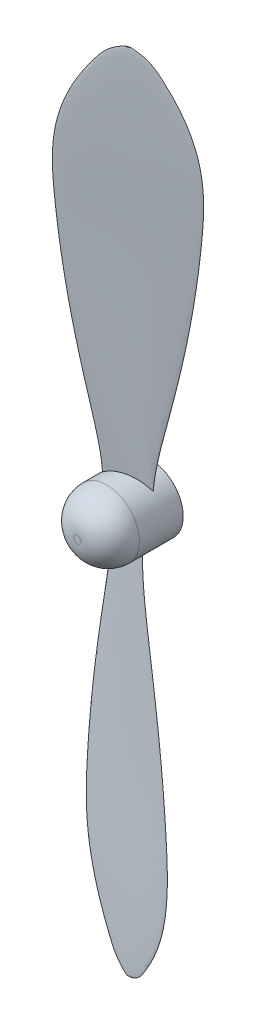
ISO-10303-21;
HEADER;
FILE_DESCRIPTION(('STEP AP214'),'2;1');
FILE_NAME('part.step','',(''),(''),'','','');
FILE_SCHEMA(('AUTOMOTIVE_DESIGN { 1 0 10303 214 1 1 1 1 }'));
ENDSEC;
DATA;
#1=APPLICATION_CONTEXT('core data for automotive mechanical design processes');
#2=APPLICATION_PROTOCOL_DEFINITION('international standard','automotive_design',2000,#1);
#3=PRODUCT_CONTEXT('',#1,'mechanical');
#4=PRODUCT('Part','Part','',(#3));
#5=PRODUCT_RELATED_PRODUCT_CATEGORY('part','',(#4));
#6=PRODUCT_DEFINITION_FORMATION('','',#4);
#7=PRODUCT_DEFINITION_CONTEXT('part definition',#1,'design');
#8=PRODUCT_DEFINITION('design','',#6,#7);
#9=PRODUCT_DEFINITION_SHAPE('','',#8);
#10=(LENGTH_UNIT() NAMED_UNIT(*) SI_UNIT(.MILLI.,.METRE.));
#11=(NAMED_UNIT(*) PLANE_ANGLE_UNIT() SI_UNIT($,.RADIAN.));
#12=(NAMED_UNIT(*) SI_UNIT($,.STERADIAN.) SOLID_ANGLE_UNIT());
#13=UNCERTAINTY_MEASURE_WITH_UNIT(LENGTH_MEASURE(1.E-05),#10,'distance_accuracy_value','');
#14=(GEOMETRIC_REPRESENTATION_CONTEXT(3) GLOBAL_UNCERTAINTY_ASSIGNED_CONTEXT((#13)) GLOBAL_UNIT_ASSIGNED_CONTEXT((#10,
#11,#12)) REPRESENTATION_CONTEXT('',''));
#15=CARTESIAN_POINT('',(0.,0.,0.));
#16=DIRECTION('',(0.,0.,1.));
#17=DIRECTION('',(1.,0.,0.));
#18=AXIS2_PLACEMENT_3D('',#15,#16,#17);
#19=CARTESIAN_POINT('',(0.,0.,5.));
#20=DIRECTION('',(0.,0.,-1.));
#21=DIRECTION('',(-1.,0.,0.));
#22=AXIS2_PLACEMENT_3D('',#19,#20,#21);
#23=CYLINDRICAL_SURFACE('',#22,2.25);
#24=CARTESIAN_POINT('',(-1.43012937491018,-1.73701755057887,1.26210136019516));
#25=CARTESIAN_POINT('',(-1.42627730098306,-1.74018918283405,1.2651812697507));
#26=CARTESIAN_POINT('',(-1.42229353114245,-1.74344727010508,1.26798046715533));
#27=CARTESIAN_POINT('',(-1.41417352633398,-1.75004018973661,1.27328275386022));
#28=CARTESIAN_POINT('',(-1.41003692457186,-1.75337519839039,1.27578506068246));
#29=CARTESIAN_POINT('',(-1.39751439830624,-1.7633966007962,1.28301306349312));
#30=CARTESIAN_POINT('',(-1.38900024148499,-1.77011216487163,1.28747056829164));
#31=CARTESIAN_POINT('',(-1.37176014206546,-1.78350600608475,1.29601983511171));
#32=CARTESIAN_POINT('',(-1.36303410852782,-1.79018426564244,1.30011143642547));
#33=CARTESIAN_POINT('',(-1.34541869181432,-1.80346060110813,1.30806454081328));
#34=CARTESIAN_POINT('',(-1.33652931630657,-1.81005868075614,1.31192605465289));
#35=CARTESIAN_POINT('',(-1.31861317230057,-1.82315179555349,1.31949391670666));
#36=CARTESIAN_POINT('',(-1.30958642898261,-1.82964684915271,1.32320029290217));
#37=CARTESIAN_POINT('',(-1.28222719275497,-1.84902525146359,1.33419236248769));
#38=CARTESIAN_POINT('',(-1.26370438147752,-1.86173494194235,1.3413121571484));
#39=CARTESIAN_POINT('',(-1.22621988175902,-1.88663499225736,1.35530213004647));
#40=CARTESIAN_POINT('',(-1.20725814649797,-1.89882529629304,1.36217228145166));
#41=CARTESIAN_POINT('',(-1.14976181679798,-1.93457598660748,1.38255680616824));
#42=CARTESIAN_POINT('',(-1.11062617619587,-1.95730900637558,1.39584135310773));
#43=CARTESIAN_POINT('',(-1.03092709462752,-2.00043651288723,1.42214829747575));
#44=CARTESIAN_POINT('',(-0.990361711548577,-2.02082764484629,1.43517029733368));
#45=CARTESIAN_POINT('',(-0.908029773390485,-2.05913678758251,1.46104088751944));
#46=CARTESIAN_POINT('',(-0.866263237022504,-2.07705483685934,1.47388948054397));
#47=CARTESIAN_POINT('',(-0.763176867334977,-2.11762244716238,1.50504897018614));
#48=CARTESIAN_POINT('',(-0.701293729216792,-2.13891442401614,1.5232913827589));
#49=CARTESIAN_POINT('',(-0.575835512832741,-2.17605265664409,1.55947227018605));
#50=CARTESIAN_POINT('',(-0.51225983083582,-2.19189694040516,1.57741063274801));
#51=CARTESIAN_POINT('',(-0.319749764156709,-2.23099561249753,1.63058704235148));
#52=CARTESIAN_POINT('',(-0.188801383326926,-2.24590670098961,1.66525586717295));
#53=CARTESIAN_POINT('',(0.00731878008617,-2.25092309746144,1.71462707725299));
#54=CARTESIAN_POINT('',(0.0721143462410426,-2.24978139162854,1.73052616771764));
#55=CARTESIAN_POINT('',(0.201546108393227,-2.24188978725587,1.7613479633818));
#56=CARTESIAN_POINT('',(0.266182401272134,-2.2351460514963,1.77627172208976));
#57=CARTESIAN_POINT('',(0.394696256237683,-2.21606046218447,1.80487724244067));
#58=CARTESIAN_POINT('',(0.458575525275932,-2.20373565462247,1.81856263476867));
#59=CARTESIAN_POINT('',(0.553605764733706,-2.18107334255815,1.83794681752174));
#60=CARTESIAN_POINT('',(0.585148862005221,-2.17282412017082,1.84421715738511));
#61=CARTESIAN_POINT('',(0.647946146791634,-2.15493242358984,1.85633510440017));
#62=CARTESIAN_POINT('',(0.679200057000381,-2.14528873517461,1.8621823364064));
#63=CARTESIAN_POINT('',(0.791524206363653,-2.10791636437563,1.88247233205087));
#64=CARTESIAN_POINT('',(0.871566238360122,-2.07612421818082,1.89555315790925));
#65=CARTESIAN_POINT('',(0.98877544840822,-2.02155516830734,1.91174364503403));
#66=CARTESIAN_POINT('',(1.02736182400173,-2.00222341104627,1.91656803582859));
#67=CARTESIAN_POINT('',(1.10347236774716,-1.96130350975961,1.92476672625642));
#68=CARTESIAN_POINT('',(1.14099717404463,-1.93971675956036,1.92814191513429));
#69=CARTESIAN_POINT('',(1.19622969025396,-1.90578002111456,1.93149999808377));
#70=CARTESIAN_POINT('',(1.21439791746294,-1.8942548843203,1.93233525906924));
#71=CARTESIAN_POINT('',(1.25040092192503,-1.87068424966642,1.93320102588878));
#72=CARTESIAN_POINT('',(1.2682359817236,-1.8586392243555,1.93323224773634));
#73=CARTESIAN_POINT('',(1.29472224262363,-1.84019304429392,1.93214881138535));
#74=CARTESIAN_POINT('',(1.30351768099679,-1.83397301570828,1.93159785723519));
#75=CARTESIAN_POINT('',(1.31660315578641,-1.82457801838737,1.93026991061706));
#76=CARTESIAN_POINT('',(1.32094344499253,-1.82143818251809,1.92974432506945));
#77=CARTESIAN_POINT('',(1.32957730351759,-1.81514534626992,1.92845158701695));
#78=CARTESIAN_POINT('',(1.33387090499503,-1.81199235733558,1.92768461333409));
#79=CARTESIAN_POINT('',(1.34104106960578,-1.80668815234397,1.92605196339709));
#80=CARTESIAN_POINT('',(1.34393930201517,-1.80453321257282,1.92529287707411));
#81=CARTESIAN_POINT('',(1.3496816677114,-1.8002422409971,1.92347237128541));
#82=CARTESIAN_POINT('',(1.35252561777659,-1.79810628301748,1.92241007321192));
#83=CARTESIAN_POINT('',(1.3566624369194,-1.79498471014418,1.92036294672426));
#84=CARTESIAN_POINT('',(1.35802707816952,-1.79395240864377,1.91959942356238));
#85=CARTESIAN_POINT('',(1.36064551733082,-1.7919671833057,1.9178308608889));
#86=CARTESIAN_POINT('',(1.36190023380739,-1.79101360649092,1.9168281507442));
#87=CARTESIAN_POINT('',(1.36377376029367,-1.78958711022807,1.91481286622395));
#88=CARTESIAN_POINT('',(1.36446550854193,-1.78905962897698,1.91391368695025));
#89=CARTESIAN_POINT('',(1.36559474432996,-1.7881978423501,1.91184890917785));
#90=CARTESIAN_POINT('',(1.36602935412294,-1.78786572358928,1.91068049145184));
#91=CARTESIAN_POINT('',(1.3664133073392,-1.78757230492423,1.90839778594303));
#92=CARTESIAN_POINT('',(1.36642375293312,-1.7875643136705,1.90730011737585));
#93=CARTESIAN_POINT('',(1.36613560554632,-1.78778452855413,1.90492171352382));
#94=CARTESIAN_POINT('',(1.36576368904413,-1.7880687760985,1.9036587064476));
#95=CARTESIAN_POINT('',(1.36442229371529,-1.78909276184338,1.90032460466254));
#96=CARTESIAN_POINT('',(1.36321280996347,-1.79001494658081,1.89842903575379));
#97=CARTESIAN_POINT('',(1.35965810867661,-1.79271800282304,1.89370222434664));
#98=CARTESIAN_POINT('',(1.35711047004374,-1.79464812679893,1.89114467117337));
#99=CARTESIAN_POINT('',(1.35179270069192,-1.79865726183781,1.88637999825993));
#100=CARTESIAN_POINT('',(1.34902116547587,-1.80073720219013,1.88417539892957));
#101=CARTESIAN_POINT('',(1.34286226259158,-1.80533600307534,1.87964018466074));
#102=CARTESIAN_POINT('',(1.33945183886456,-1.8078681100533,1.87735473396329));
#103=CARTESIAN_POINT('',(1.33253795700963,-1.81297026404127,1.87297311206057));
#104=CARTESIAN_POINT('',(1.329034434048,-1.81554033690634,1.87087707748431));
#105=CARTESIAN_POINT('',(1.31841648716249,-1.82328127041223,1.86477651937803));
#106=CARTESIAN_POINT('',(1.31120629962159,-1.82847416225836,1.86096734800756));
#107=CARTESIAN_POINT('',(1.29663908725461,-1.83883308390307,1.85363768127148));
#108=CARTESIAN_POINT('',(1.28928221971682,-1.84399913569955,1.85011689539719));
#109=CARTESIAN_POINT('',(1.27445656392441,-1.85427660434088,1.84326846518212));
#110=CARTESIAN_POINT('',(1.26698792029297,-1.85938807921869,1.8399405945343));
#111=CARTESIAN_POINT('',(1.2444721542099,-1.87459766730284,1.83016787127763));
#112=CARTESIAN_POINT('',(1.22927618821936,-1.88459870691961,1.82391514123486));
#113=CARTESIAN_POINT('',(1.19856194529044,-1.90428001875776,1.81170061029289));
#114=CARTESIAN_POINT('',(1.18304362325804,-1.91396024560266,1.80573885049328));
#115=CARTESIAN_POINT('',(1.13604009276097,-1.94248712855706,1.78812103615439));
#116=CARTESIAN_POINT('',(1.10412803850875,-1.96080529709816,1.77674142332814));
#117=CARTESIAN_POINT('',(1.03934812081587,-1.99589913391118,1.75433990071525));
#118=CARTESIAN_POINT('',(1.00648027803455,-2.0126748354909,1.7433179832079));
#119=CARTESIAN_POINT('',(0.939907017368027,-2.04461200378222,1.72149532457363));
#120=CARTESIAN_POINT('',(0.906201719572812,-2.05977370031106,1.71069455213535));
#121=CARTESIAN_POINT('',(0.811851212796631,-2.09944467935005,1.68099412340004));
#122=CARTESIAN_POINT('',(0.750401328291804,-2.12218737818029,1.66224678290651));
#123=CARTESIAN_POINT('',(0.625654416194334,-2.16225781299235,1.62510719807578));
#124=CARTESIAN_POINT('',(0.562356614684253,-2.17958324356457,1.60671510803676));
#125=CARTESIAN_POINT('',(0.370227090864609,-2.22320796265501,1.55208983822742));
#126=CARTESIAN_POINT('',(0.239211394992104,-2.24113375755034,1.51642383496307));
#127=CARTESIAN_POINT('',(-0.0241660288045987,-2.2537250218089,1.44800243844608));
#128=CARTESIAN_POINT('',(-0.156522088861996,-2.24846494147039,1.41523807319113));
#129=CARTESIAN_POINT('',(-0.419201012066724,-2.21455455541909,1.35422240402856));
#130=CARTESIAN_POINT('',(-0.549526346367785,-2.18593538369389,1.32596515274044));
#131=CARTESIAN_POINT('',(-0.757215900260988,-2.12043503578414,1.28557303050876));
#132=CARTESIAN_POINT('',(-0.836402300838936,-2.0904825028443,1.27133383104788));
#133=CARTESIAN_POINT('',(-0.952561399074344,-2.03885262430701,1.25276365783739));
#134=CARTESIAN_POINT('',(-0.990824563102937,-2.02053741361478,1.2470406901195));
#135=CARTESIAN_POINT('',(-1.06636595553104,-1.98170785255329,1.23668612248366));
#136=CARTESIAN_POINT('',(-1.10364445270086,-1.96119411018143,1.23205422196163));
#137=CARTESIAN_POINT('',(-1.16528683385198,-1.92495275499664,1.22543289565216));
#138=CARTESIAN_POINT('',(-1.18995349873452,-1.90980376558116,1.22307255919502));
#139=CARTESIAN_POINT('',(-1.23871831137304,-1.87854062736546,1.21914666318388));
#140=CARTESIAN_POINT('',(-1.26281678997477,-1.86242706058859,1.21758062964785));
#141=CARTESIAN_POINT('',(-1.29880186410289,-1.83734448643498,1.21608746138379));
#142=CARTESIAN_POINT('',(-1.31091411964239,-1.82872235977377,1.21573353639337));
#143=CARTESIAN_POINT('',(-1.33496999980197,-1.81123605022215,1.2154333033231));
#144=CARTESIAN_POINT('',(-1.34691363775548,-1.80237188663527,1.21548696283063));
#145=CARTESIAN_POINT('',(-1.36690469874096,-1.78722579620278,1.21610767295485));
#146=CARTESIAN_POINT('',(-1.37500256375023,-1.78100318651321,1.21650893313783));
#147=CARTESIAN_POINT('',(-1.39108509807677,-1.76846987977644,1.21775187874519));
#148=CARTESIAN_POINT('',(-1.39906992728473,-1.7621593389908,1.21859286094983));
#149=CARTESIAN_POINT('',(-1.41093423727422,-1.75265242642872,1.22049912929994));
#150=CARTESIAN_POINT('',(-1.41487728420558,-1.74947075525248,1.22124397190004));
#151=CARTESIAN_POINT('',(-1.42269192522162,-1.74312154604754,1.22307780694234));
#152=CARTESIAN_POINT('',(-1.42656367437295,-1.73995399260986,1.22416592709056));
#153=CARTESIAN_POINT('',(-1.43225988436448,-1.73526305479861,1.22634655350924));
#154=CARTESIAN_POINT('',(-1.43415195832395,-1.7336995299367,1.22717202016953));
#155=CARTESIAN_POINT('',(-1.43782699361923,-1.73065277646049,1.22913319294804));
#156=CARTESIAN_POINT('',(-1.43961079920771,-1.72916894106795,1.23026597253503));
#157=CARTESIAN_POINT('',(-1.44218830487449,-1.72701894333437,1.23257695632497));
#158=CARTESIAN_POINT('',(-1.44308567882021,-1.72626900360472,1.23354120830588));
#159=CARTESIAN_POINT('',(-1.44437730247413,-1.72518831200847,1.23550683417056));
#160=CARTESIAN_POINT('',(-1.44484207279322,-1.72479898381967,1.2364217834954));
#161=CARTESIAN_POINT('',(-1.44542992299782,-1.72430637662608,1.23826776936884));
#162=CARTESIAN_POINT('',(-1.44559454391923,-1.72416832688196,1.23917471463481));
#163=CARTESIAN_POINT('',(-1.44567597873517,-1.72410004504534,1.2410026905147));
#164=CARTESIAN_POINT('',(-1.44559305971028,-1.72416958897185,1.24192370488186));
#165=CARTESIAN_POINT('',(-1.44515431158457,-1.72453736205483,1.24417253940145));
#166=CARTESIAN_POINT('',(-1.44467597127344,-1.72493823179279,1.24545363416216));
#167=CARTESIAN_POINT('',(-1.44340689639828,-1.72600039011717,1.24808882220727));
#168=CARTESIAN_POINT('',(-1.44257151067965,-1.72669880650507,1.24940114624108));
#169=CARTESIAN_POINT('',(-1.44076787879869,-1.72820408150578,1.2518683959097));
#170=CARTESIAN_POINT('',(-1.43979890036856,-1.72901153726259,1.25302237879393));
#171=CARTESIAN_POINT('',(-1.43609628463647,-1.73209110868959,1.25709264921252));
#172=CARTESIAN_POINT('',(-1.43315341117724,-1.73452768897526,1.25968350467851));
#173=CARTESIAN_POINT('',(-1.43012937491018,-1.73701755057887,1.26210136019516));
#174=B_SPLINE_CURVE_WITH_KNOTS('',3,(#24,#25,#26,#27,#28,#29,#30,#31,#32,#33,#34,#35,#36,#37,
#38,#39,#40,#41,#42,#43,#44,#45,#46,#47,#48,#49,#50,#51,#52,#53,#54,#55,#56,#57,#58,#59,#60,#61,
#62,#63,#64,#65,#66,#67,#68,#69,#70,#71,#72,#73,#74,#75,#76,#77,#78,#79,#80,#81,#82,#83,#84,#85,
#86,#87,#88,#89,#90,#91,#92,#93,#94,#95,#96,#97,#98,#99,#100,#101,#102,#103,#104,#105,#106,#107,
#108,#109,#110,#111,#112,#113,#114,#115,#116,#117,#118,#119,#120,#121,#122,#123,#124,#125,#126,
#127,#128,#129,#130,#131,#132,#133,#134,#135,#136,#137,#138,#139,#140,#141,#142,#143,#144,#145,
#146,#147,#148,#149,#150,#151,#152,#153,#154,#155,#156,#157,#158,#159,#160,#161,#162,#163,#164,
#165,#166,#167,#168,#169,#170,#171,#172,#173),.UNSPECIFIED.,.T.,.F.,(4,2,2,2,2,2,2,2,2,2,2,2,2,
2,2,2,2,2,2,2,2,2,2,2,2,2,2,2,2,2,2,2,2,2,2,2,2,2,2,2,2,2,2,2,2,2,2,2,2,2,2,2,2,2,2,2,2,2,2,2,2,
2,2,2,2,2,2,2,2,2,2,2,2,2,4),(0.,0.0175672893459573,0.0351798958794233,0.0703369443059093,
0.105509358925106,0.140680126566584,0.175844523066675,0.246526172514476,0.317215396635003,
0.458632643844367,0.60025001079763,0.741865172876198,0.945411008834283,1.14903044906727,
1.55550526842822,1.75550498789899,1.95528497906134,2.15445886523248,2.25403171071304,
2.35369178657355,2.61423337023615,2.74445005909755,2.87458673112869,2.93916779456945,
3.00369134524646,3.03603592484405,3.05218120479553,3.06831455225096,3.07938267394465,
3.09048319879269,3.09609622559036,3.10165667316514,3.10537436787315,3.10913291828254,
3.11234777345128,3.11631937498771,3.12351251706756,3.135740155478,3.14805155111837,
3.16251173231523,3.17698226198885,3.205972635336,3.23493343620896,3.26385954572251,
3.32155759622695,3.3792637731395,3.49475917034124,3.61025207296619,3.72572850856502,
3.92991401201862,4.13418629215102,4.54290514360815,4.95031254857543,5.35717782868862,
5.61414329257833,5.74248867360541,5.87079865224049,5.95790254738962,6.04495440395643,
6.08956478605171,6.13417162060305,6.16482939740233,6.1954382944371,6.21079896814162,
6.22612091942364,6.23388330908203,6.24157422606157,6.24607334974281,6.24930934677446,
6.25204792538692,6.25478355030742,6.25898626879085,6.26407698505297,6.26919680528932,
6.28298784904947),.UNSPECIFIED.);
#175=CARTESIAN_POINT('',(-1.43012937491018,-1.73701755057887,1.26210136019516));
#176=VERTEX_POINT('',#175);
#177=EDGE_CURVE('E115',#176,#176,#174,.T.);
#178=ORIENTED_EDGE('',*,*,#177,.T.);
#179=EDGE_LOOP('',(#178));
#180=FACE_BOUND('',#179,.T.);
#181=CARTESIAN_POINT('',(1.43012937491018,1.73701755057887,1.26210136019516));
#182=CARTESIAN_POINT('',(1.42627730098306,1.74018918283405,1.2651812697507));
#183=CARTESIAN_POINT('',(1.42229353114245,1.74344727010508,1.26798046715533));
#184=CARTESIAN_POINT('',(1.41417352633398,1.75004018973661,1.27328275386022));
#185=CARTESIAN_POINT('',(1.41003692457186,1.75337519839039,1.27578506068246));
#186=CARTESIAN_POINT('',(1.39751439830624,1.7633966007962,1.28301306349312));
#187=CARTESIAN_POINT('',(1.38900024148499,1.77011216487163,1.28747056829164));
#188=CARTESIAN_POINT('',(1.37176014206546,1.78350600608475,1.29601983511171));
#189=CARTESIAN_POINT('',(1.36303410852782,1.79018426564244,1.30011143642547));
#190=CARTESIAN_POINT('',(1.34541869181432,1.80346060110813,1.30806454081328));
#191=CARTESIAN_POINT('',(1.33652931630657,1.81005868075614,1.31192605465289));
#192=CARTESIAN_POINT('',(1.31861317230057,1.82315179555349,1.31949391670666));
#193=CARTESIAN_POINT('',(1.30958642898261,1.82964684915271,1.32320029290217));
#194=CARTESIAN_POINT('',(1.28222719275497,1.84902525146359,1.33419236248769));
#195=CARTESIAN_POINT('',(1.26370438147752,1.86173494194235,1.3413121571484));
#196=CARTESIAN_POINT('',(1.22621988175902,1.88663499225736,1.35530213004647));
#197=CARTESIAN_POINT('',(1.20725814649797,1.89882529629304,1.36217228145166));
#198=CARTESIAN_POINT('',(1.14976181679798,1.93457598660748,1.38255680616824));
#199=CARTESIAN_POINT('',(1.11062617619587,1.95730900637558,1.39584135310773));
#200=CARTESIAN_POINT('',(1.03092709462752,2.00043651288723,1.42214829747575));
#201=CARTESIAN_POINT('',(0.990361711548577,2.02082764484629,1.43517029733368));
#202=CARTESIAN_POINT('',(0.908029773390485,2.05913678758251,1.46104088751944));
#203=CARTESIAN_POINT('',(0.866263237022504,2.07705483685934,1.47388948054397));
#204=CARTESIAN_POINT('',(0.763176867334977,2.11762244716238,1.50504897018614));
#205=CARTESIAN_POINT('',(0.701293729216792,2.13891442401614,1.5232913827589));
#206=CARTESIAN_POINT('',(0.575835512832741,2.17605265664409,1.55947227018605));
#207=CARTESIAN_POINT('',(0.51225983083582,2.19189694040516,1.57741063274801));
#208=CARTESIAN_POINT('',(0.319749764156709,2.23099561249753,1.63058704235148));
#209=CARTESIAN_POINT('',(0.188801383326926,2.24590670098961,1.66525586717295));
#210=CARTESIAN_POINT('',(-0.00731878008617,2.25092309746144,1.71462707725299));
#211=CARTESIAN_POINT('',(-0.0721143462410426,2.24978139162854,1.73052616771764));
#212=CARTESIAN_POINT('',(-0.201546108393227,2.24188978725587,1.7613479633818));
#213=CARTESIAN_POINT('',(-0.266182401272134,2.2351460514963,1.77627172208976));
#214=CARTESIAN_POINT('',(-0.394696256237683,2.21606046218447,1.80487724244067));
#215=CARTESIAN_POINT('',(-0.458575525275932,2.20373565462247,1.81856263476867));
#216=CARTESIAN_POINT('',(-0.553605764733706,2.18107334255815,1.83794681752174));
#217=CARTESIAN_POINT('',(-0.585148862005221,2.17282412017082,1.84421715738511));
#218=CARTESIAN_POINT('',(-0.647946146791634,2.15493242358984,1.85633510440017));
#219=CARTESIAN_POINT('',(-0.679200057000381,2.14528873517461,1.8621823364064));
#220=CARTESIAN_POINT('',(-0.791524206363653,2.10791636437563,1.88247233205087));
#221=CARTESIAN_POINT('',(-0.871566238360122,2.07612421818082,1.89555315790925));
#222=CARTESIAN_POINT('',(-0.98877544840822,2.02155516830734,1.91174364503403));
#223=CARTESIAN_POINT('',(-1.02736182400173,2.00222341104627,1.91656803582859));
#224=CARTESIAN_POINT('',(-1.10347236774716,1.96130350975961,1.92476672625642));
#225=CARTESIAN_POINT('',(-1.14099717404463,1.93971675956036,1.92814191513429));
#226=CARTESIAN_POINT('',(-1.19622969025396,1.90578002111456,1.93149999808377));
#227=CARTESIAN_POINT('',(-1.21439791746294,1.8942548843203,1.93233525906924));
#228=CARTESIAN_POINT('',(-1.25040092192503,1.87068424966642,1.93320102588878));
#229=CARTESIAN_POINT('',(-1.2682359817236,1.8586392243555,1.93323224773634));
#230=CARTESIAN_POINT('',(-1.29472224262363,1.84019304429392,1.93214881138535));
#231=CARTESIAN_POINT('',(-1.30351768099679,1.83397301570828,1.93159785723519));
#232=CARTESIAN_POINT('',(-1.31660315578641,1.82457801838737,1.93026991061706));
#233=CARTESIAN_POINT('',(-1.32094344499253,1.82143818251809,1.92974432506945));
#234=CARTESIAN_POINT('',(-1.32957730351759,1.81514534626992,1.92845158701695));
#235=CARTESIAN_POINT('',(-1.33387090499503,1.81199235733558,1.92768461333409));
#236=CARTESIAN_POINT('',(-1.34104106960578,1.80668815234397,1.92605196339709));
#237=CARTESIAN_POINT('',(-1.34393930201517,1.80453321257282,1.92529287707411));
#238=CARTESIAN_POINT('',(-1.3496816677114,1.8002422409971,1.92347237128541));
#239=CARTESIAN_POINT('',(-1.35252561777659,1.79810628301748,1.92241007321192));
#240=CARTESIAN_POINT('',(-1.3566624369194,1.79498471014418,1.92036294672426));
#241=CARTESIAN_POINT('',(-1.35802707816952,1.79395240864377,1.91959942356238));
#242=CARTESIAN_POINT('',(-1.36064551733082,1.7919671833057,1.9178308608889));
#243=CARTESIAN_POINT('',(-1.36190023380739,1.79101360649092,1.9168281507442));
#244=CARTESIAN_POINT('',(-1.36377376029367,1.78958711022807,1.91481286622395));
#245=CARTESIAN_POINT('',(-1.36446550854193,1.78905962897698,1.91391368695025));
#246=CARTESIAN_POINT('',(-1.36559474432996,1.7881978423501,1.91184890917785));
#247=CARTESIAN_POINT('',(-1.36602935412294,1.78786572358928,1.91068049145184));
#248=CARTESIAN_POINT('',(-1.3664133073392,1.78757230492423,1.90839778594303));
#249=CARTESIAN_POINT('',(-1.36642375293312,1.7875643136705,1.90730011737585));
#250=CARTESIAN_POINT('',(-1.36613560554632,1.78778452855413,1.90492171352382));
#251=CARTESIAN_POINT('',(-1.36576368904413,1.7880687760985,1.9036587064476));
#252=CARTESIAN_POINT('',(-1.36442229371529,1.78909276184338,1.90032460466254));
#253=CARTESIAN_POINT('',(-1.36321280996347,1.79001494658081,1.89842903575379));
#254=CARTESIAN_POINT('',(-1.35965810867661,1.79271800282304,1.89370222434664));
#255=CARTESIAN_POINT('',(-1.35711047004374,1.79464812679893,1.89114467117337));
#256=CARTESIAN_POINT('',(-1.35179270069192,1.79865726183781,1.88637999825993));
#257=CARTESIAN_POINT('',(-1.34902116547587,1.80073720219013,1.88417539892957));
#258=CARTESIAN_POINT('',(-1.34286226259158,1.80533600307534,1.87964018466074));
#259=CARTESIAN_POINT('',(-1.33945183886456,1.8078681100533,1.87735473396329));
#260=CARTESIAN_POINT('',(-1.33253795700963,1.81297026404127,1.87297311206057));
#261=CARTESIAN_POINT('',(-1.329034434048,1.81554033690634,1.87087707748431));
#262=CARTESIAN_POINT('',(-1.31841648716249,1.82328127041223,1.86477651937803));
#263=CARTESIAN_POINT('',(-1.31120629962159,1.82847416225836,1.86096734800756));
#264=CARTESIAN_POINT('',(-1.29663908725461,1.83883308390307,1.85363768127148));
#265=CARTESIAN_POINT('',(-1.28928221971682,1.84399913569955,1.85011689539719));
#266=CARTESIAN_POINT('',(-1.27445656392441,1.85427660434088,1.84326846518212));
#267=CARTESIAN_POINT('',(-1.26698792029297,1.85938807921869,1.8399405945343));
#268=CARTESIAN_POINT('',(-1.2444721542099,1.87459766730284,1.83016787127763));
#269=CARTESIAN_POINT('',(-1.22927618821936,1.88459870691961,1.82391514123486));
#270=CARTESIAN_POINT('',(-1.19856194529044,1.90428001875776,1.81170061029289));
#271=CARTESIAN_POINT('',(-1.18304362325804,1.91396024560266,1.80573885049328));
#272=CARTESIAN_POINT('',(-1.13604009276097,1.94248712855706,1.78812103615439));
#273=CARTESIAN_POINT('',(-1.10412803850875,1.96080529709816,1.77674142332814));
#274=CARTESIAN_POINT('',(-1.03934812081587,1.99589913391118,1.75433990071525));
#275=CARTESIAN_POINT('',(-1.00648027803455,2.0126748354909,1.7433179832079));
#276=CARTESIAN_POINT('',(-0.939907017368027,2.04461200378222,1.72149532457363));
#277=CARTESIAN_POINT('',(-0.906201719572812,2.05977370031106,1.71069455213535));
#278=CARTESIAN_POINT('',(-0.811851212796631,2.09944467935005,1.68099412340004));
#279=CARTESIAN_POINT('',(-0.750401328291804,2.12218737818029,1.66224678290651));
#280=CARTESIAN_POINT('',(-0.625654416194334,2.16225781299235,1.62510719807578));
#281=CARTESIAN_POINT('',(-0.562356614684253,2.17958324356457,1.60671510803676));
#282=CARTESIAN_POINT('',(-0.370227090864609,2.22320796265501,1.55208983822742));
#283=CARTESIAN_POINT('',(-0.239211394992104,2.24113375755034,1.51642383496307));
#284=CARTESIAN_POINT('',(0.0241660288045987,2.2537250218089,1.44800243844608));
#285=CARTESIAN_POINT('',(0.156522088861996,2.24846494147039,1.41523807319113));
#286=CARTESIAN_POINT('',(0.419201012066724,2.21455455541909,1.35422240402856));
#287=CARTESIAN_POINT('',(0.549526346367785,2.18593538369389,1.32596515274044));
#288=CARTESIAN_POINT('',(0.757215900260988,2.12043503578414,1.28557303050876));
#289=CARTESIAN_POINT('',(0.836402300838936,2.0904825028443,1.27133383104788));
#290=CARTESIAN_POINT('',(0.952561399074344,2.03885262430701,1.25276365783739));
#291=CARTESIAN_POINT('',(0.990824563102937,2.02053741361478,1.2470406901195));
#292=CARTESIAN_POINT('',(1.06636595553104,1.98170785255329,1.23668612248366));
#293=CARTESIAN_POINT('',(1.10364445270086,1.96119411018143,1.23205422196163));
#294=CARTESIAN_POINT('',(1.16528683385198,1.92495275499664,1.22543289565216));
#295=CARTESIAN_POINT('',(1.18995349873452,1.90980376558116,1.22307255919502));
#296=CARTESIAN_POINT('',(1.23871831137304,1.87854062736546,1.21914666318388));
#297=CARTESIAN_POINT('',(1.26281678997477,1.86242706058859,1.21758062964785));
#298=CARTESIAN_POINT('',(1.29880186410289,1.83734448643498,1.21608746138379));
#299=CARTESIAN_POINT('',(1.31091411964239,1.82872235977377,1.21573353639337));
#300=CARTESIAN_POINT('',(1.33496999980197,1.81123605022215,1.2154333033231));
#301=CARTESIAN_POINT('',(1.34691363775548,1.80237188663527,1.21548696283063));
#302=CARTESIAN_POINT('',(1.36690469874096,1.78722579620278,1.21610767295485));
#303=CARTESIAN_POINT('',(1.37500256375023,1.78100318651321,1.21650893313783));
#304=CARTESIAN_POINT('',(1.39108509807677,1.76846987977644,1.21775187874519));
#305=CARTESIAN_POINT('',(1.39906992728473,1.7621593389908,1.21859286094983));
#306=CARTESIAN_POINT('',(1.41093423727422,1.75265242642872,1.22049912929994));
#307=CARTESIAN_POINT('',(1.41487728420558,1.74947075525248,1.22124397190004));
#308=CARTESIAN_POINT('',(1.42269192522162,1.74312154604754,1.22307780694234));
#309=CARTESIAN_POINT('',(1.42656367437295,1.73995399260986,1.22416592709056));
#310=CARTESIAN_POINT('',(1.43225988436448,1.73526305479861,1.22634655350924));
#311=CARTESIAN_POINT('',(1.43415195832395,1.7336995299367,1.22717202016953));
#312=CARTESIAN_POINT('',(1.43782699361923,1.73065277646049,1.22913319294804));
#313=CARTESIAN_POINT('',(1.43961079920771,1.72916894106795,1.23026597253503));
#314=CARTESIAN_POINT('',(1.44218830487449,1.72701894333437,1.23257695632497));
#315=CARTESIAN_POINT('',(1.44308567882021,1.72626900360472,1.23354120830588));
#316=CARTESIAN_POINT('',(1.44437730247413,1.72518831200847,1.23550683417056));
#317=CARTESIAN_POINT('',(1.44484207279322,1.72479898381967,1.2364217834954));
#318=CARTESIAN_POINT('',(1.44542992299782,1.72430637662608,1.23826776936884));
#319=CARTESIAN_POINT('',(1.44559454391923,1.72416832688196,1.23917471463481));
#320=CARTESIAN_POINT('',(1.44567597873517,1.72410004504534,1.2410026905147));
#321=CARTESIAN_POINT('',(1.44559305971028,1.72416958897185,1.24192370488186));
#322=CARTESIAN_POINT('',(1.44515431158457,1.72453736205483,1.24417253940145));
#323=CARTESIAN_POINT('',(1.44467597127344,1.72493823179279,1.24545363416216));
#324=CARTESIAN_POINT('',(1.44340689639828,1.72600039011717,1.24808882220727));
#325=CARTESIAN_POINT('',(1.44257151067965,1.72669880650507,1.24940114624108));
#326=CARTESIAN_POINT('',(1.44076787879869,1.72820408150578,1.2518683959097));
#327=CARTESIAN_POINT('',(1.43979890036856,1.72901153726259,1.25302237879393));
#328=CARTESIAN_POINT('',(1.43609628463647,1.73209110868959,1.25709264921252));
#329=CARTESIAN_POINT('',(1.43315341117724,1.73452768897526,1.25968350467851));
#330=CARTESIAN_POINT('',(1.43012937491018,1.73701755057887,1.26210136019516));
#331=B_SPLINE_CURVE_WITH_KNOTS('',3,(#181,#182,#183,#184,#185,#186,#187,#188,#189,#190,#191,
#192,#193,#194,#195,#196,#197,#198,#199,#200,#201,#202,#203,#204,#205,#206,#207,#208,#209,#210,
#211,#212,#213,#214,#215,#216,#217,#218,#219,#220,#221,#222,#223,#224,#225,#226,#227,#228,#229,
#230,#231,#232,#233,#234,#235,#236,#237,#238,#239,#240,#241,#242,#243,#244,#245,#246,#247,#248,
#249,#250,#251,#252,#253,#254,#255,#256,#257,#258,#259,#260,#261,#262,#263,#264,#265,#266,#267,
#268,#269,#270,#271,#272,#273,#274,#275,#276,#277,#278,#279,#280,#281,#282,#283,#284,#285,#286,
#287,#288,#289,#290,#291,#292,#293,#294,#295,#296,#297,#298,#299,#300,#301,#302,#303,#304,#305,
#306,#307,#308,#309,#310,#311,#312,#313,#314,#315,#316,#317,#318,#319,#320,#321,#322,#323,#324,
#325,#326,#327,#328,#329,#330),.UNSPECIFIED.,.T.,.F.,(4,2,2,2,2,2,2,2,2,2,2,2,2,2,2,2,2,2,2,2,2,
2,2,2,2,2,2,2,2,2,2,2,2,2,2,2,2,2,2,2,2,2,2,2,2,2,2,2,2,2,2,2,2,2,2,2,2,2,2,2,2,2,2,2,2,2,2,2,2,
2,2,2,2,2,4),(0.,0.0175672893459573,0.0351798958794233,0.0703369443059093,0.105509358925106,
0.140680126566584,0.175844523066675,0.246526172514476,0.317215396635003,0.458632643844367,
0.60025001079763,0.741865172876198,0.945411008834283,1.14903044906727,1.55550526842822,
1.75550498789899,1.95528497906134,2.15445886523248,2.25403171071304,2.35369178657355,
2.61423337023615,2.74445005909755,2.87458673112869,2.93916779456945,3.00369134524646,
3.03603592484405,3.05218120479553,3.06831455225096,3.07938267394465,3.09048319879269,
3.09609622559036,3.10165667316514,3.10537436787315,3.10913291828254,3.11234777345128,
3.11631937498771,3.12351251706756,3.135740155478,3.14805155111837,3.16251173231523,
3.17698226198885,3.205972635336,3.23493343620896,3.26385954572251,3.32155759622695,
3.3792637731395,3.49475917034124,3.61025207296619,3.72572850856502,3.92991401201862,
4.13418629215102,4.54290514360815,4.95031254857543,5.35717782868862,5.61414329257833,
5.74248867360541,5.87079865224049,5.95790254738962,6.04495440395643,6.08956478605171,
6.13417162060305,6.16482939740233,6.1954382944371,6.21079896814162,6.22612091942364,
6.23388330908203,6.24157422606157,6.24607334974281,6.24930934677446,6.25204792538692,
6.25478355030742,6.25898626879085,6.26407698505297,6.26919680528932,6.28298784904947),.UNSPECIFIED.);
#332=CARTESIAN_POINT('',(1.43012937491018,1.73701755057887,1.26210136019516));
#333=VERTEX_POINT('',#332);
#334=EDGE_CURVE('E130',#333,#333,#331,.T.);
#335=ORIENTED_EDGE('',*,*,#334,.T.);
#336=EDGE_LOOP('',(#335));
#337=FACE_BOUND('',#336,.T.);
#338=CARTESIAN_POINT('',(0.,0.,3.));
#339=DIRECTION('',(0.,0.,1.));
#340=DIRECTION('',(1.,0.,0.));
#341=AXIS2_PLACEMENT_3D('',#338,#339,#340);
#342=CIRCLE('',#341,2.25);
#343=CARTESIAN_POINT('',(2.25,0.,3.));
#344=VERTEX_POINT('',#343);
#345=EDGE_CURVE('E11',#344,#344,#342,.F.);
#346=ORIENTED_EDGE('',*,*,#345,.T.);
#347=EDGE_LOOP('',(#346));
#348=FACE_BOUND('',#347,.T.);
#349=CARTESIAN_POINT('',(0.,0.,0.));
#350=DIRECTION('',(0.,0.,1.));
#351=DIRECTION('',(1.,0.,0.));
#352=AXIS2_PLACEMENT_3D('',#349,#350,#351);
#353=CIRCLE('',#352,2.25);
#354=CARTESIAN_POINT('',(2.25,0.,0.));
#355=VERTEX_POINT('',#354);
#356=EDGE_CURVE('E127',#355,#355,#353,.T.);
#357=ORIENTED_EDGE('',*,*,#356,.T.);
#358=EDGE_LOOP('',(#357));
#359=FACE_BOUND('',#358,.T.);
#360=ADVANCED_FACE('F111',(#180,#337,#348,#359),#23,.T.);
#361=CARTESIAN_POINT('',(0.,0.,5.));
#362=DIRECTION('',(0.,0.,1.));
#363=DIRECTION('',(1.,0.,0.));
#364=AXIS2_PLACEMENT_3D('',#361,#362,#363);
#365=PLANE('',#364);
#366=CARTESIAN_POINT('',(0.,0.,5.));
#367=DIRECTION('',(0.,0.,1.));
#368=DIRECTION('',(1.,0.,0.));
#369=AXIS2_PLACEMENT_3D('',#366,#367,#368);
#370=CIRCLE('',#369,0.25);
#371=CARTESIAN_POINT('',(0.25,0.,5.));
#372=VERTEX_POINT('',#371);
#373=EDGE_CURVE('E122',#372,#372,#370,.T.);
#374=ORIENTED_EDGE('',*,*,#373,.T.);
#375=EDGE_LOOP('',(#374));
#376=FACE_BOUND('',#375,.T.);
#377=ADVANCED_FACE('F148',(#376),#365,.T.);
#378=CARTESIAN_POINT('',(0.,0.,0.));
#379=DIRECTION('',(0.,0.,1.));
#380=DIRECTION('',(1.,0.,0.));
#381=AXIS2_PLACEMENT_3D('',#378,#379,#380);
#382=PLANE('',#381);
#383=ORIENTED_EDGE('',*,*,#356,.F.);
#384=EDGE_LOOP('',(#383));
#385=FACE_BOUND('',#384,.T.);
#386=ADVANCED_FACE('F184',(#385),#382,.F.);
#387=CARTESIAN_POINT('',(0.,0.,3.));
#388=DIRECTION('',(0.,0.,1.));
#389=DIRECTION('',(1.,0.,0.));
#390=AXIS2_PLACEMENT_3D('',#387,#388,#389);
#391=DEGENERATE_TOROIDAL_SURFACE('',#390,0.25,2.,.T.);
#392=ORIENTED_EDGE('',*,*,#345,.F.);
#393=EDGE_LOOP('',(#392));
#394=FACE_BOUND('',#393,.T.);
#395=ORIENTED_EDGE('',*,*,#373,.F.);
#396=EDGE_LOOP('',(#395));
#397=FACE_BOUND('',#396,.T.);
#398=ADVANCED_FACE('F113',(#394,#397),#391,.T.);
#399=CARTESIAN_POINT('',(-0.00927510756969095,27.5,1.60418734350063));
#400=CARTESIAN_POINT('',(0.0766478225143852,27.0853144536608,1.6143931614695));
#401=CARTESIAN_POINT('',(0.479077175913039,23.6835798562959,1.59571685060892));
#402=CARTESIAN_POINT('',(1.04165383137569,14.8398494367891,1.317952067221));
#403=CARTESIAN_POINT('',(1.32636719092297,6.4207905976502,1.29330503045913));
#404=CARTESIAN_POINT('',(1.44690851940689,1.,1.25732170860358));
#405=CARTESIAN_POINT('',(-0.013283284353137,27.5,1.60528871941575));
#406=CARTESIAN_POINT('',(0.0480135551266976,27.0841737129179,1.62332303824522));
#407=CARTESIAN_POINT('',(0.368861631061895,23.687566751979,1.63028929017964));
#408=CARTESIAN_POINT('',(0.929845867319966,14.836885005718,1.35112414062736));
#409=CARTESIAN_POINT('',(1.26862079675442,6.41960596809421,1.31266463477927));
#410=CARTESIAN_POINT('',(1.44914644449929,1.,1.25976496620037));
#411=CARTESIAN_POINT('',(-0.0211129493794069,27.5,1.60738766974094));
#412=CARTESIAN_POINT('',(-0.00937897488011467,27.0825362130379,1.64109634648939));
#413=CARTESIAN_POINT('',(0.151574677419588,23.6932827582211,1.69812139962126));
#414=CARTESIAN_POINT('',(0.704721164649009,14.8329014772048,1.41780256112413));
#415=CARTESIAN_POINT('',(1.15024086893345,6.41690601521413,1.35194786481483));
#416=CARTESIAN_POINT('',(1.4504235043099,1.,1.26531778844351));
#417=CARTESIAN_POINT('',(-0.0322727046100778,27.5,1.61022396052977));
#418=CARTESIAN_POINT('',(-0.093617410186806,27.0820905931624,1.66680809293008));
#419=CARTESIAN_POINT('',(-0.170563469454316,23.6948093971477,1.79776290801103));
#420=CARTESIAN_POINT('',(0.3682379544163,14.8329285795256,1.51700746141086));
#421=CARTESIAN_POINT('',(0.969210953989414,6.41208574497417,1.41109196325877));
#422=CARTESIAN_POINT('',(1.44308556784024,1.,1.27554099973939));
#423=CARTESIAN_POINT('',(-0.0428230408451483,27.5,1.61274738643589));
#424=CARTESIAN_POINT('',(-0.176006512090474,27.0835798129355,1.69159003757099));
#425=CARTESIAN_POINT('',(-0.486801528851627,23.6895552506577,1.89466324138463));
#426=CARTESIAN_POINT('',(0.0337868598864669,14.8386958162079,1.61519803416977));
#427=CARTESIAN_POINT('',(0.784392763203022,6.40665654308512,1.47054092449221));
#428=CARTESIAN_POINT('',(1.42683695012209,1.,1.28755324574889));
#429=CARTESIAN_POINT('',(-0.102320484160767,27.5,1.62600637147367));
#430=CARTESIAN_POINT('',(-0.656236572863807,27.1034248028326,1.8338718742749));
#431=CARTESIAN_POINT('',(-2.34667037821803,23.619795616322,2.45908873157896));
#432=CARTESIAN_POINT('',(-1.94979210143899,14.9057046032192,2.19509592981229));
#433=CARTESIAN_POINT('',(-0.339212848937449,6.37050302289589,1.82677357270444));
#434=CARTESIAN_POINT('',(1.27793822594439,1.,1.36973127078227));
#435=CARTESIAN_POINT('',(-0.126781644835929,27.5,1.62338874667742));
#436=CARTESIAN_POINT('',(-0.965263283737898,27.205367900226,1.90753197366563));
#437=CARTESIAN_POINT('',(-3.80977966799182,23.2625427677155,2.86080005422505));
#438=CARTESIAN_POINT('',(-3.51383736709164,15.2075989250088,2.63156114920399));
#439=CARTESIAN_POINT('',(-1.51016659524651,6.34041483373569,2.15646253114964));
#440=CARTESIAN_POINT('',(0.741141235242604,1.,1.52340615872865));
#441=CARTESIAN_POINT('',(-0.0774362113117111,27.5,1.5865487549284));
#442=CARTESIAN_POINT('',(-0.951881439080887,27.2206629663119,1.85209389916509));
#443=CARTESIAN_POINT('',(-4.40730610969096,23.2091040427339,2.88685406821946));
#444=CARTESIAN_POINT('',(-4.37388186464659,15.2466681049038,2.83296708532527));
#445=CARTESIAN_POINT('',(-2.74448130426455,6.35879105492825,2.41961532451493));
#446=CARTESIAN_POINT('',(-0.658594681937152,1.,1.83924078577818));
#447=CARTESIAN_POINT('',(0.00990320919441347,27.5,1.5520488698847));
#448=CARTESIAN_POINT('',(-0.491017754366226,27.0898654792231,1.6821732868776));
#449=CARTESIAN_POINT('',(-2.85110880466186,23.6676774726932,2.33676128920927));
#450=CARTESIAN_POINT('',(-3.00015907433439,14.8515423418465,2.39255850737478));
#451=CARTESIAN_POINT('',(-2.27279735671316,6.42600866841924,2.19770076108134));
#452=CARTESIAN_POINT('',(-1.32627070871625,1.,1.94202273577169));
#453=CARTESIAN_POINT('',(0.170230280532257,27.5,1.50799383327983));
#454=CARTESIAN_POINT('',(0.504943204226058,27.0806468641589,1.37238612824861));
#455=CARTESIAN_POINT('',(2.0790579958443,23.6998872085822,0.788314052444572));
#456=CARTESIAN_POINT('',(1.10862395897398,14.8279468345004,1.18343865273335));
#457=CARTESIAN_POINT('',(-0.209042074055403,6.41510873918017,1.49253331333221));
#458=CARTESIAN_POINT('',(-1.41578771241235,1.,1.84429243190032));
#459=CARTESIAN_POINT('',(0.213056108076709,27.5,1.50672661598891));
#460=CARTESIAN_POINT('',(1.00987865481641,27.2022257361835,1.24080751617736));
#461=CARTESIAN_POINT('',(3.9778075507425,23.2735235145119,0.255543240429298));
#462=CARTESIAN_POINT('',(3.41346638843954,15.1994770902115,0.529243746851755));
#463=CARTESIAN_POINT('',(1.39986981096033,6.33699119645011,1.027666121031));
#464=CARTESIAN_POINT('',(-0.820788139419989,1.,1.66216587004978));
#465=CARTESIAN_POINT('',(0.163710674552491,27.5,1.54356660773794));
#466=CARTESIAN_POINT('',(1.06887860527847,27.2207170434491,1.27330019883527));
#467=CARTESIAN_POINT('',(4.32257255906547,23.2088983214937,0.309642736411019));
#468=CARTESIAN_POINT('',(4.45339993577774,15.2474519334592,0.269778393495177));
#469=CARTESIAN_POINT('',(2.73953325597342,6.35648192080546,0.734917926999291));
#470=CARTESIAN_POINT('',(0.578947777759767,1.,1.34633124300025));
#471=CARTESIAN_POINT('',(0.0996594665532612,27.5,1.57050586212173));
#472=CARTESIAN_POINT('',(0.782686429996357,27.153761021648,1.38515598894225));
#473=CARTESIAN_POINT('',(3.22147076571895,23.443894219396,0.712409139141953));
#474=CARTESIAN_POINT('',(3.66892654429727,15.0355899763362,0.528293038459291));
#475=CARTESIAN_POINT('',(2.58522826173263,6.42616896556395,0.847084471887291));
#476=CARTESIAN_POINT('',(1.16516475703653,1.,1.24661069111665));
#477=CARTESIAN_POINT('',(0.0270636124689192,27.5,1.59354377319546));
#478=CARTESIAN_POINT('',(0.324497913920853,27.1026995342307,1.53549537755844));
#479=CARTESIAN_POINT('',(1.43062772142878,23.6227339887143,1.29322301752032));
#480=CARTESIAN_POINT('',(1.98528759210351,14.8882944081535,1.03611413038295));
#481=CARTESIAN_POINT('',(1.79695352548804,6.42683406920072,1.13137692936172));
#482=CARTESIAN_POINT('',(1.38781644191458,1.,1.24495255574724));
#483=CARTESIAN_POINT('',(0.014920964082303,27.5,1.59725597711679));
#484=CARTESIAN_POINT('',(0.244785009847454,27.0953770929238,1.5612664931294));
#485=CARTESIAN_POINT('',(1.12279215518678,23.6483736732141,1.39208187057946));
#486=CARTESIAN_POINT('',(1.68729579586904,14.8674302234051,1.12556793364923));
#487=CARTESIAN_POINT('',(1.65287610862879,6.4259784543866,1.18208980332133));
#488=CARTESIAN_POINT('',(1.41673545878183,1.,1.24677323429826));
#489=CARTESIAN_POINT('',(0.00278530220483335,27.5,1.60082085392156));
#490=CARTESIAN_POINT('',(0.162275820329574,27.0893806574954,1.58755852550644));
#491=CARTESIAN_POINT('',(0.805491846823555,23.6693613841226,1.49301468042562));
#492=CARTESIAN_POINT('',(1.37341785991568,14.8506880636314,1.21934270254));
#493=CARTESIAN_POINT('',(1.4968034366943,6.42401379255003,1.23588216735408));
#494=CARTESIAN_POINT('',(1.43708015650503,1.,1.25075017132288));
#495=CARTESIAN_POINT('',(-0.00526693078624486,27.5,1.60308596758551));
#496=CARTESIAN_POINT('',(0.105282089902073,27.0864551944037,1.60546328469378));
#497=CARTESIAN_POINT('',(0.589292720764182,23.6795929606128,1.5611444110382));
#498=CARTESIAN_POINT('',(1.15346179543141,14.8428138678602,1.28477999381464));
#499=CARTESIAN_POINT('',(1.38411358509152,6.42197522720618,1.27394542613899));
#500=CARTESIAN_POINT('',(1.44467059431449,1.,1.2548784510068));
#501=CARTESIAN_POINT('',(-0.00927510756969095,27.5,1.60418734350063));
#502=CARTESIAN_POINT('',(0.0766478225143852,27.0853144536608,1.6143931614695));
#503=CARTESIAN_POINT('',(0.479077175913039,23.6835798562959,1.59571685060892));
#504=CARTESIAN_POINT('',(1.04165383137569,14.8398494367891,1.317952067221));
#505=CARTESIAN_POINT('',(1.32636719092297,6.4207905976502,1.29330503045913));
#506=CARTESIAN_POINT('',(1.44690851940689,1.,1.25732170860358));
#507=B_SPLINE_SURFACE_WITH_KNOTS('',3,3,((#399,#400,#401,#402,#403,#404),(#405,#406,#407,#408,
#409,#410),(#411,#412,#413,#414,#415,#416),(#417,#418,#419,#420,#421,#422),(#423,#424,#425,#426,
#427,#428),(#429,#430,#431,#432,#433,#434),(#435,#436,#437,#438,#439,#440),(#441,#442,#443,#444,
#445,#446),(#447,#448,#449,#450,#451,#452),(#453,#454,#455,#456,#457,#458),(#459,#460,#461,#462,
#463,#464),(#465,#466,#467,#468,#469,#470),(#471,#472,#473,#474,#475,#476),(#477,#478,#479,#480,
#481,#482),(#483,#484,#485,#486,#487,#488),(#489,#490,#491,#492,#493,#494),(#495,#496,#497,#498,
#499,#500),(#501,#502,#503,#504,#505,#506)),.UNSPECIFIED.,.T.,.F.,.F.,(4,1,1,1,1,2,2,2,1,1,1,1,
4),(4,1,1,4),(0.,0.0125,0.0249999999999999,0.0375000000000001,0.05,0.25,0.5,0.75,0.95,0.9625,
0.975,0.9875,1.),(0.,0.0475600455709539,0.387546064678264,1.),.UNSPECIFIED.);
#508=CARTESIAN_POINT('',(0.0403958186468223,27.5,1.56710434754145));
#509=DIRECTION('',(0.,1.,0.));
#510=DIRECTION('',(-0.949513390758797,0.,0.313726506323153));
#511=AXIS2_PLACEMENT_3D('',#508,#509,#510);
#512=ELLIPSE('',#511,0.161516535188667,0.0210736502129475);
#513=CARTESIAN_POINT('',(-0.112966294343781,27.5,1.61777636583961));
#514=VERTEX_POINT('',#513);
#515=EDGE_CURVE('E135',#514,#514,#512,.T.);
#516=ORIENTED_EDGE('',*,*,#515,.F.);
#517=EDGE_LOOP('',(#516));
#518=FACE_BOUND('',#517,.T.);
#519=ORIENTED_EDGE('',*,*,#334,.F.);
#520=EDGE_LOOP('',(#519));
#521=FACE_BOUND('',#520,.T.);
#522=ADVANCED_FACE('F138',(#518,#521),#507,.T.);
#523=CARTESIAN_POINT('',(0.0403958186468223,27.5,1.56710434754145));
#524=DIRECTION('',(0.,-1.,0.));
#525=DIRECTION('',(0.,0.,-1.));
#526=AXIS2_PLACEMENT_3D('',#523,#524,#525);
#527=PLANE('',#526);
#528=ORIENTED_EDGE('',*,*,#515,.T.);
#529=EDGE_LOOP('',(#528));
#530=FACE_BOUND('',#529,.T.);
#531=ADVANCED_FACE('F145',(#530),#527,.F.);
#532=CARTESIAN_POINT('',(0.00927510756969095,-27.5,1.60418734350063));
#533=CARTESIAN_POINT('',(-0.0766478225143852,-27.0853144536608,1.6143931614695));
#534=CARTESIAN_POINT('',(-0.479077175913039,-23.6835798562959,1.59571685060892));
#535=CARTESIAN_POINT('',(-1.04165383137569,-14.8398494367891,1.317952067221));
#536=CARTESIAN_POINT('',(-1.32636719092297,-6.4207905976502,1.29330503045913));
#537=CARTESIAN_POINT('',(-1.44690851940689,-1.,1.25732170860358));
#538=CARTESIAN_POINT('',(0.013283284353137,-27.5,1.60528871941575));
#539=CARTESIAN_POINT('',(-0.0480135551266976,-27.0841737129179,1.62332303824522));
#540=CARTESIAN_POINT('',(-0.368861631061895,-23.687566751979,1.63028929017964));
#541=CARTESIAN_POINT('',(-0.929845867319966,-14.836885005718,1.35112414062736));
#542=CARTESIAN_POINT('',(-1.26862079675442,-6.41960596809421,1.31266463477927));
#543=CARTESIAN_POINT('',(-1.44914644449929,-1.,1.25976496620037));
#544=CARTESIAN_POINT('',(0.0211129493794069,-27.5,1.60738766974094));
#545=CARTESIAN_POINT('',(0.00937897488011467,-27.0825362130379,1.64109634648939));
#546=CARTESIAN_POINT('',(-0.151574677419588,-23.6932827582211,1.69812139962126));
#547=CARTESIAN_POINT('',(-0.704721164649009,-14.8329014772048,1.41780256112413));
#548=CARTESIAN_POINT('',(-1.15024086893345,-6.41690601521413,1.35194786481483));
#549=CARTESIAN_POINT('',(-1.4504235043099,-1.,1.26531778844351));
#550=CARTESIAN_POINT('',(0.0322727046100778,-27.5,1.61022396052977));
#551=CARTESIAN_POINT('',(0.093617410186806,-27.0820905931624,1.66680809293008));
#552=CARTESIAN_POINT('',(0.170563469454316,-23.6948093971477,1.79776290801103));
#553=CARTESIAN_POINT('',(-0.3682379544163,-14.8329285795256,1.51700746141086));
#554=CARTESIAN_POINT('',(-0.969210953989414,-6.41208574497417,1.41109196325877));
#555=CARTESIAN_POINT('',(-1.44308556784024,-1.,1.27554099973939));
#556=CARTESIAN_POINT('',(0.0428230408451483,-27.5,1.61274738643589));
#557=CARTESIAN_POINT('',(0.176006512090474,-27.0835798129355,1.69159003757099));
#558=CARTESIAN_POINT('',(0.486801528851627,-23.6895552506577,1.89466324138463));
#559=CARTESIAN_POINT('',(-0.0337868598864669,-14.8386958162079,1.61519803416977));
#560=CARTESIAN_POINT('',(-0.784392763203022,-6.40665654308512,1.47054092449221));
#561=CARTESIAN_POINT('',(-1.42683695012209,-1.,1.28755324574889));
#562=CARTESIAN_POINT('',(0.102320484160767,-27.5,1.62600637147367));
#563=CARTESIAN_POINT('',(0.656236572863807,-27.1034248028326,1.8338718742749));
#564=CARTESIAN_POINT('',(2.34667037821803,-23.619795616322,2.45908873157896));
#565=CARTESIAN_POINT('',(1.94979210143899,-14.9057046032192,2.19509592981229));
#566=CARTESIAN_POINT('',(0.339212848937449,-6.37050302289589,1.82677357270444));
#567=CARTESIAN_POINT('',(-1.27793822594439,-1.,1.36973127078227));
#568=CARTESIAN_POINT('',(0.126781644835929,-27.5,1.62338874667742));
#569=CARTESIAN_POINT('',(0.965263283737898,-27.205367900226,1.90753197366563));
#570=CARTESIAN_POINT('',(3.80977966799182,-23.2625427677155,2.86080005422505));
#571=CARTESIAN_POINT('',(3.51383736709164,-15.2075989250088,2.63156114920399));
#572=CARTESIAN_POINT('',(1.51016659524651,-6.34041483373569,2.15646253114964));
#573=CARTESIAN_POINT('',(-0.741141235242604,-1.,1.52340615872865));
#574=CARTESIAN_POINT('',(0.0774362113117111,-27.5,1.5865487549284));
#575=CARTESIAN_POINT('',(0.951881439080887,-27.2206629663119,1.85209389916509));
#576=CARTESIAN_POINT('',(4.40730610969096,-23.2091040427339,2.88685406821946));
#577=CARTESIAN_POINT('',(4.37388186464659,-15.2466681049038,2.83296708532527));
#578=CARTESIAN_POINT('',(2.74448130426455,-6.35879105492825,2.41961532451493));
#579=CARTESIAN_POINT('',(0.658594681937152,-1.,1.83924078577818));
#580=CARTESIAN_POINT('',(-0.00990320919441347,-27.5,1.5520488698847));
#581=CARTESIAN_POINT('',(0.491017754366226,-27.0898654792231,1.6821732868776));
#582=CARTESIAN_POINT('',(2.85110880466186,-23.6676774726932,2.33676128920927));
#583=CARTESIAN_POINT('',(3.00015907433439,-14.8515423418465,2.39255850737478));
#584=CARTESIAN_POINT('',(2.27279735671316,-6.42600866841924,2.19770076108134));
#585=CARTESIAN_POINT('',(1.32627070871625,-1.,1.94202273577169));
#586=CARTESIAN_POINT('',(-0.170230280532257,-27.5,1.50799383327983));
#587=CARTESIAN_POINT('',(-0.504943204226058,-27.0806468641589,1.37238612824861));
#588=CARTESIAN_POINT('',(-2.0790579958443,-23.6998872085822,0.788314052444572));
#589=CARTESIAN_POINT('',(-1.10862395897398,-14.8279468345004,1.18343865273335));
#590=CARTESIAN_POINT('',(0.209042074055403,-6.41510873918017,1.49253331333221));
#591=CARTESIAN_POINT('',(1.41578771241235,-1.,1.84429243190032));
#592=CARTESIAN_POINT('',(-0.213056108076709,-27.5,1.50672661598891));
#593=CARTESIAN_POINT('',(-1.00987865481641,-27.2022257361835,1.24080751617736));
#594=CARTESIAN_POINT('',(-3.9778075507425,-23.2735235145119,0.255543240429298));
#595=CARTESIAN_POINT('',(-3.41346638843954,-15.1994770902115,0.529243746851755));
#596=CARTESIAN_POINT('',(-1.39986981096033,-6.33699119645011,1.027666121031));
#597=CARTESIAN_POINT('',(0.820788139419989,-1.,1.66216587004978));
#598=CARTESIAN_POINT('',(-0.163710674552491,-27.5,1.54356660773794));
#599=CARTESIAN_POINT('',(-1.06887860527847,-27.2207170434491,1.27330019883527));
#600=CARTESIAN_POINT('',(-4.32257255906547,-23.2088983214937,0.309642736411019));
#601=CARTESIAN_POINT('',(-4.45339993577774,-15.2474519334592,0.269778393495177));
#602=CARTESIAN_POINT('',(-2.73953325597342,-6.35648192080546,0.734917926999291));
#603=CARTESIAN_POINT('',(-0.578947777759767,-1.,1.34633124300025));
#604=CARTESIAN_POINT('',(-0.0996594665532612,-27.5,1.57050586212173));
#605=CARTESIAN_POINT('',(-0.782686429996357,-27.153761021648,1.38515598894225));
#606=CARTESIAN_POINT('',(-3.22147076571895,-23.443894219396,0.712409139141953));
#607=CARTESIAN_POINT('',(-3.66892654429727,-15.0355899763362,0.528293038459291));
#608=CARTESIAN_POINT('',(-2.58522826173263,-6.42616896556395,0.847084471887291));
#609=CARTESIAN_POINT('',(-1.16516475703653,-1.,1.24661069111665));
#610=CARTESIAN_POINT('',(-0.0270636124689192,-27.5,1.59354377319546));
#611=CARTESIAN_POINT('',(-0.324497913920853,-27.1026995342307,1.53549537755844));
#612=CARTESIAN_POINT('',(-1.43062772142878,-23.6227339887143,1.29322301752032));
#613=CARTESIAN_POINT('',(-1.98528759210351,-14.8882944081535,1.03611413038295));
#614=CARTESIAN_POINT('',(-1.79695352548804,-6.42683406920072,1.13137692936172));
#615=CARTESIAN_POINT('',(-1.38781644191458,-1.,1.24495255574724));
#616=CARTESIAN_POINT('',(-0.014920964082303,-27.5,1.59725597711679));
#617=CARTESIAN_POINT('',(-0.244785009847454,-27.0953770929238,1.5612664931294));
#618=CARTESIAN_POINT('',(-1.12279215518678,-23.6483736732141,1.39208187057946));
#619=CARTESIAN_POINT('',(-1.68729579586904,-14.8674302234051,1.12556793364923));
#620=CARTESIAN_POINT('',(-1.65287610862879,-6.4259784543866,1.18208980332133));
#621=CARTESIAN_POINT('',(-1.41673545878183,-1.,1.24677323429826));
#622=CARTESIAN_POINT('',(-0.00278530220483335,-27.5,1.60082085392156));
#623=CARTESIAN_POINT('',(-0.162275820329574,-27.0893806574954,1.58755852550644));
#624=CARTESIAN_POINT('',(-0.805491846823555,-23.6693613841226,1.49301468042562));
#625=CARTESIAN_POINT('',(-1.37341785991568,-14.8506880636314,1.21934270254));
#626=CARTESIAN_POINT('',(-1.4968034366943,-6.42401379255003,1.23588216735408));
#627=CARTESIAN_POINT('',(-1.43708015650503,-1.,1.25075017132288));
#628=CARTESIAN_POINT('',(0.00526693078624486,-27.5,1.60308596758551));
#629=CARTESIAN_POINT('',(-0.105282089902073,-27.0864551944037,1.60546328469378));
#630=CARTESIAN_POINT('',(-0.589292720764182,-23.6795929606128,1.5611444110382));
#631=CARTESIAN_POINT('',(-1.15346179543141,-14.8428138678602,1.28477999381464));
#632=CARTESIAN_POINT('',(-1.38411358509152,-6.42197522720618,1.27394542613899));
#633=CARTESIAN_POINT('',(-1.44467059431449,-1.,1.2548784510068));
#634=CARTESIAN_POINT('',(0.00927510756969095,-27.5,1.60418734350063));
#635=CARTESIAN_POINT('',(-0.0766478225143852,-27.0853144536608,1.6143931614695));
#636=CARTESIAN_POINT('',(-0.479077175913039,-23.6835798562959,1.59571685060892));
#637=CARTESIAN_POINT('',(-1.04165383137569,-14.8398494367891,1.317952067221));
#638=CARTESIAN_POINT('',(-1.32636719092297,-6.4207905976502,1.29330503045913));
#639=CARTESIAN_POINT('',(-1.44690851940689,-1.,1.25732170860358));
#640=B_SPLINE_SURFACE_WITH_KNOTS('',3,3,((#532,#533,#534,#535,#536,#537),(#538,#539,#540,#541,
#542,#543),(#544,#545,#546,#547,#548,#549),(#550,#551,#552,#553,#554,#555),(#556,#557,#558,#559,
#560,#561),(#562,#563,#564,#565,#566,#567),(#568,#569,#570,#571,#572,#573),(#574,#575,#576,#577,
#578,#579),(#580,#581,#582,#583,#584,#585),(#586,#587,#588,#589,#590,#591),(#592,#593,#594,#595,
#596,#597),(#598,#599,#600,#601,#602,#603),(#604,#605,#606,#607,#608,#609),(#610,#611,#612,#613,
#614,#615),(#616,#617,#618,#619,#620,#621),(#622,#623,#624,#625,#626,#627),(#628,#629,#630,#631,
#632,#633),(#634,#635,#636,#637,#638,#639)),.UNSPECIFIED.,.T.,.F.,.F.,(4,1,1,1,1,2,2,2,1,1,1,1,
4),(4,1,1,4),(0.,0.0125,0.0249999999999999,0.0375000000000001,0.05,0.25,0.5,0.75,0.95,0.9625,
0.975,0.9875,1.),(0.,0.0475600455709539,0.387546064678264,1.),.UNSPECIFIED.);
#641=CARTESIAN_POINT('',(-0.0403958186468223,-27.5,1.56710434754145));
#642=DIRECTION('',(0.,-1.,0.));
#643=DIRECTION('',(0.949513390758797,0.,0.313726506323153));
#644=AXIS2_PLACEMENT_3D('',#641,#642,#643);
#645=ELLIPSE('',#644,0.161516535188667,0.0210736502129475);
#646=CARTESIAN_POINT('',(0.112966294343781,-27.5,1.61777636583961));
#647=VERTEX_POINT('',#646);
#648=EDGE_CURVE('E202',#647,#647,#645,.T.);
#649=ORIENTED_EDGE('',*,*,#648,.F.);
#650=EDGE_LOOP('',(#649));
#651=FACE_BOUND('',#650,.T.);
#652=ORIENTED_EDGE('',*,*,#177,.F.);
#653=EDGE_LOOP('',(#652));
#654=FACE_BOUND('',#653,.T.);
#655=ADVANCED_FACE('F222',(#651,#654),#640,.T.);
#656=CARTESIAN_POINT('',(-0.0403958186468223,-27.5,1.56710434754145));
#657=DIRECTION('',(0.,1.,0.));
#658=DIRECTION('',(0.,0.,-1.));
#659=AXIS2_PLACEMENT_3D('',#656,#657,#658);
#660=PLANE('',#659);
#661=ORIENTED_EDGE('',*,*,#648,.T.);
#662=EDGE_LOOP('',(#661));
#663=FACE_BOUND('',#662,.T.);
#664=ADVANCED_FACE('F214',(#663),#660,.F.);
#665=CLOSED_SHELL('',(#360,#377,#386,#398,#522,#531,#655,#664));
#666=MANIFOLD_SOLID_BREP('B2',#665);
#667=ADVANCED_BREP_SHAPE_REPRESENTATION('',(#18,#666),#14);
#668=SHAPE_DEFINITION_REPRESENTATION(#9,#667);
ENDSEC;
END-ISO-10303-21;
